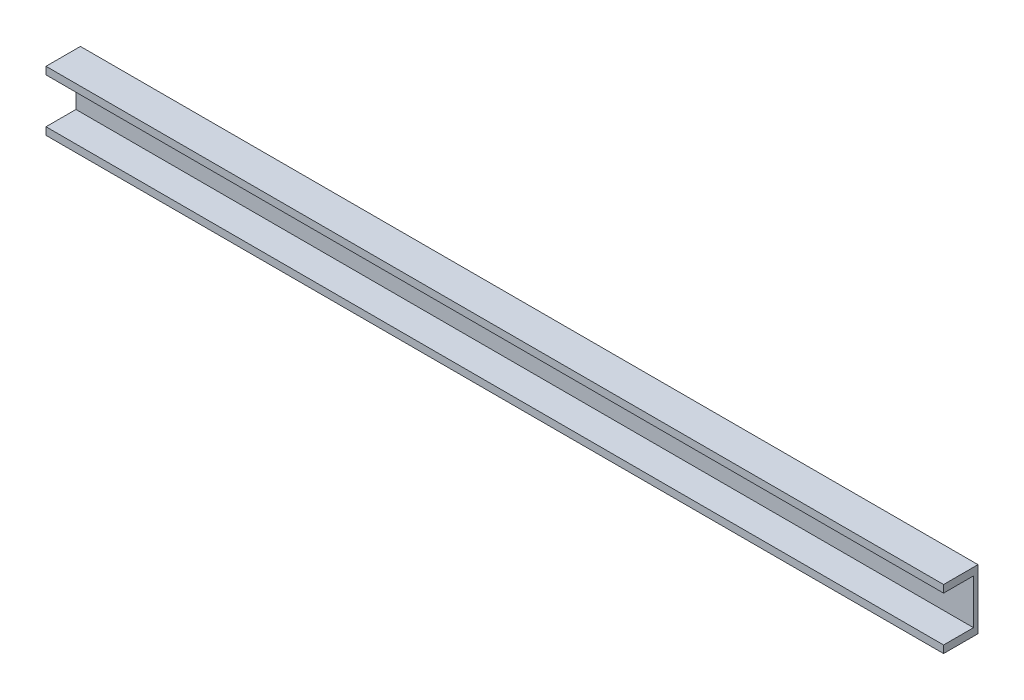
ISO-10303-21;
HEADER;
FILE_DESCRIPTION(('STEP AP214'),'2;1');
FILE_NAME('part.step','',(''),(''),'','','');
FILE_SCHEMA(('AUTOMOTIVE_DESIGN { 1 0 10303 214 1 1 1 1 }'));
ENDSEC;
DATA;
#1=APPLICATION_CONTEXT('core data for automotive mechanical design processes');
#2=APPLICATION_PROTOCOL_DEFINITION('international standard','automotive_design',2000,#1);
#3=PRODUCT_CONTEXT('',#1,'mechanical');
#4=PRODUCT('Part','Part','',(#3));
#5=PRODUCT_RELATED_PRODUCT_CATEGORY('part','',(#4));
#6=PRODUCT_DEFINITION_FORMATION('','',#4);
#7=PRODUCT_DEFINITION_CONTEXT('part definition',#1,'design');
#8=PRODUCT_DEFINITION('design','',#6,#7);
#9=PRODUCT_DEFINITION_SHAPE('','',#8);
#10=(LENGTH_UNIT() NAMED_UNIT(*) SI_UNIT(.MILLI.,.METRE.));
#11=(NAMED_UNIT(*) PLANE_ANGLE_UNIT() SI_UNIT($,.RADIAN.));
#12=(NAMED_UNIT(*) SI_UNIT($,.STERADIAN.) SOLID_ANGLE_UNIT());
#13=UNCERTAINTY_MEASURE_WITH_UNIT(LENGTH_MEASURE(1.E-05),#10,'distance_accuracy_value','');
#14=(GEOMETRIC_REPRESENTATION_CONTEXT(3) GLOBAL_UNCERTAINTY_ASSIGNED_CONTEXT((#13)) GLOBAL_UNIT_ASSIGNED_CONTEXT((#10,
#11,#12)) REPRESENTATION_CONTEXT('',''));
#15=CARTESIAN_POINT('',(0.,0.,0.));
#16=DIRECTION('',(0.,0.,1.));
#17=DIRECTION('',(1.,0.,0.));
#18=AXIS2_PLACEMENT_3D('',#15,#16,#17);
#19=CARTESIAN_POINT('',(0.,0.,3.));
#20=DIRECTION('',(0.,0.,1.));
#21=DIRECTION('',(1.,0.,0.));
#22=AXIS2_PLACEMENT_3D('',#19,#20,#21);
#23=PLANE('',#22);
#24=DIRECTION('',(0.,1.,0.));
#25=VECTOR('',#24,1.);
#26=CARTESIAN_POINT('',(-300.,0.,3.));
#27=LINE('',#26,#25);
#28=CARTESIAN_POINT('',(-300.,-15.,3.));
#29=VERTEX_POINT('',#28);
#30=CARTESIAN_POINT('',(-300.,15.,3.));
#31=VERTEX_POINT('',#30);
#32=EDGE_CURVE('E12',#29,#31,#27,.T.);
#33=ORIENTED_EDGE('',*,*,#32,.F.);
#34=DIRECTION('',(1.,0.,0.));
#35=VECTOR('',#34,1.);
#36=CARTESIAN_POINT('',(0.,-15.,3.));
#37=LINE('',#36,#35);
#38=CARTESIAN_POINT('',(300.,-15.,3.));
#39=VERTEX_POINT('',#38);
#40=EDGE_CURVE('E29',#29,#39,#37,.T.);
#41=ORIENTED_EDGE('',*,*,#40,.T.);
#42=DIRECTION('',(0.,1.,0.));
#43=VECTOR('',#42,1.);
#44=CARTESIAN_POINT('',(300.,0.,3.));
#45=LINE('',#44,#43);
#46=CARTESIAN_POINT('',(300.,15.,3.));
#47=VERTEX_POINT('',#46);
#48=EDGE_CURVE('E121',#39,#47,#45,.T.);
#49=ORIENTED_EDGE('',*,*,#48,.T.);
#50=DIRECTION('',(1.,0.,0.));
#51=VECTOR('',#50,1.);
#52=CARTESIAN_POINT('',(0.,15.,3.));
#53=LINE('',#52,#51);
#54=EDGE_CURVE('E123',#31,#47,#53,.T.);
#55=ORIENTED_EDGE('',*,*,#54,.F.);
#56=EDGE_LOOP('',(#33,#41,#49,#55));
#57=FACE_BOUND('',#56,.T.);
#58=ADVANCED_FACE('F20',(#57),#23,.T.);
#59=CARTESIAN_POINT('',(0.,-20.,3.));
#60=DIRECTION('',(0.,-1.,0.));
#61=DIRECTION('',(1.,0.,0.));
#62=AXIS2_PLACEMENT_3D('',#59,#60,#61);
#63=PLANE('',#62);
#64=DIRECTION('',(-1.,0.,0.));
#65=VECTOR('',#64,1.);
#66=CARTESIAN_POINT('',(0.,-20.,0.));
#67=LINE('',#66,#65);
#68=CARTESIAN_POINT('',(300.,-20.,0.));
#69=VERTEX_POINT('',#68);
#70=CARTESIAN_POINT('',(-300.,-20.,0.));
#71=VERTEX_POINT('',#70);
#72=EDGE_CURVE('E127',#69,#71,#67,.T.);
#73=ORIENTED_EDGE('',*,*,#72,.F.);
#74=DIRECTION('',(0.,0.,-1.));
#75=VECTOR('',#74,1.);
#76=CARTESIAN_POINT('',(300.,-20.,3.));
#77=LINE('',#76,#75);
#78=CARTESIAN_POINT('',(300.,-20.,23.));
#79=VERTEX_POINT('',#78);
#80=EDGE_CURVE('E132',#79,#69,#77,.T.);
#81=ORIENTED_EDGE('',*,*,#80,.F.);
#82=DIRECTION('',(-1.,0.,0.));
#83=VECTOR('',#82,1.);
#84=CARTESIAN_POINT('',(0.,-20.,23.));
#85=LINE('',#84,#83);
#86=CARTESIAN_POINT('',(-300.,-20.,23.));
#87=VERTEX_POINT('',#86);
#88=EDGE_CURVE('E149',#79,#87,#85,.T.);
#89=ORIENTED_EDGE('',*,*,#88,.T.);
#90=DIRECTION('',(0.,0.,-1.));
#91=VECTOR('',#90,1.);
#92=CARTESIAN_POINT('',(-300.,-20.,3.));
#93=LINE('',#92,#91);
#94=EDGE_CURVE('E145',#87,#71,#93,.T.);
#95=ORIENTED_EDGE('',*,*,#94,.T.);
#96=EDGE_LOOP('',(#73,#81,#89,#95));
#97=FACE_BOUND('',#96,.T.);
#98=ADVANCED_FACE('F189',(#97),#63,.T.);
#99=CARTESIAN_POINT('',(300.,0.,3.));
#100=DIRECTION('',(-1.,0.,0.));
#101=DIRECTION('',(0.,0.,1.));
#102=AXIS2_PLACEMENT_3D('',#99,#100,#101);
#103=PLANE('',#102);
#104=DIRECTION('',(0.,1.,0.));
#105=VECTOR('',#104,1.);
#106=CARTESIAN_POINT('',(300.,0.,0.));
#107=LINE('',#106,#105);
#108=CARTESIAN_POINT('',(300.,20.,0.));
#109=VERTEX_POINT('',#108);
#110=EDGE_CURVE('E140',#69,#109,#107,.T.);
#111=ORIENTED_EDGE('',*,*,#110,.T.);
#112=DIRECTION('',(0.,0.,-1.));
#113=VECTOR('',#112,1.);
#114=CARTESIAN_POINT('',(300.,20.,3.));
#115=LINE('',#114,#113);
#116=CARTESIAN_POINT('',(300.,20.,23.));
#117=VERTEX_POINT('',#116);
#118=EDGE_CURVE('E146',#117,#109,#115,.T.);
#119=ORIENTED_EDGE('',*,*,#118,.F.);
#120=DIRECTION('',(0.,1.,0.));
#121=VECTOR('',#120,1.);
#122=CARTESIAN_POINT('',(300.,0.,23.));
#123=LINE('',#122,#121);
#124=CARTESIAN_POINT('',(300.,15.,23.));
#125=VERTEX_POINT('',#124);
#126=EDGE_CURVE('E184',#125,#117,#123,.T.);
#127=ORIENTED_EDGE('',*,*,#126,.F.);
#128=DIRECTION('',(0.,0.,-1.));
#129=VECTOR('',#128,1.);
#130=CARTESIAN_POINT('',(300.,15.,23.));
#131=LINE('',#130,#129);
#132=EDGE_CURVE('E100',#125,#47,#131,.T.);
#133=ORIENTED_EDGE('',*,*,#132,.T.);
#134=ORIENTED_EDGE('',*,*,#48,.F.);
#135=DIRECTION('',(0.,0.,-1.));
#136=VECTOR('',#135,1.);
#137=CARTESIAN_POINT('',(300.,-15.,23.));
#138=LINE('',#137,#136);
#139=CARTESIAN_POINT('',(300.,-15.,23.));
#140=VERTEX_POINT('',#139);
#141=EDGE_CURVE('E174',#140,#39,#138,.T.);
#142=ORIENTED_EDGE('',*,*,#141,.F.);
#143=DIRECTION('',(0.,1.,0.));
#144=VECTOR('',#143,1.);
#145=CARTESIAN_POINT('',(300.,0.,23.));
#146=LINE('',#145,#144);
#147=EDGE_CURVE('E162',#79,#140,#146,.T.);
#148=ORIENTED_EDGE('',*,*,#147,.F.);
#149=ORIENTED_EDGE('',*,*,#80,.T.);
#150=EDGE_LOOP('',(#111,#119,#127,#133,#134,#142,#148,#149));
#151=FACE_BOUND('',#150,.T.);
#152=ADVANCED_FACE('F159',(#151),#103,.F.);
#153=CARTESIAN_POINT('',(0.,20.,3.));
#154=DIRECTION('',(0.,-1.,0.));
#155=DIRECTION('',(1.,0.,0.));
#156=AXIS2_PLACEMENT_3D('',#153,#154,#155);
#157=PLANE('',#156);
#158=DIRECTION('',(-1.,0.,0.));
#159=VECTOR('',#158,1.);
#160=CARTESIAN_POINT('',(0.,20.,0.));
#161=LINE('',#160,#159);
#162=CARTESIAN_POINT('',(-300.,20.,0.));
#163=VERTEX_POINT('',#162);
#164=EDGE_CURVE('E167',#109,#163,#161,.T.);
#165=ORIENTED_EDGE('',*,*,#164,.T.);
#166=DIRECTION('',(0.,0.,-1.));
#167=VECTOR('',#166,1.);
#168=CARTESIAN_POINT('',(-300.,20.,3.));
#169=LINE('',#168,#167);
#170=CARTESIAN_POINT('',(-300.,20.,23.));
#171=VERTEX_POINT('',#170);
#172=EDGE_CURVE('E171',#171,#163,#169,.T.);
#173=ORIENTED_EDGE('',*,*,#172,.F.);
#174=DIRECTION('',(-1.,0.,0.));
#175=VECTOR('',#174,1.);
#176=CARTESIAN_POINT('',(0.,20.,23.));
#177=LINE('',#176,#175);
#178=EDGE_CURVE('E108',#117,#171,#177,.T.);
#179=ORIENTED_EDGE('',*,*,#178,.F.);
#180=ORIENTED_EDGE('',*,*,#118,.T.);
#181=EDGE_LOOP('',(#165,#173,#179,#180));
#182=FACE_BOUND('',#181,.T.);
#183=ADVANCED_FACE('F187',(#182),#157,.F.);
#184=CARTESIAN_POINT('',(-300.,0.,3.));
#185=DIRECTION('',(-1.,0.,0.));
#186=DIRECTION('',(0.,0.,1.));
#187=AXIS2_PLACEMENT_3D('',#184,#185,#186);
#188=PLANE('',#187);
#189=DIRECTION('',(0.,1.,0.));
#190=VECTOR('',#189,1.);
#191=CARTESIAN_POINT('',(-300.,0.,0.));
#192=LINE('',#191,#190);
#193=EDGE_CURVE('E168',#71,#163,#192,.T.);
#194=ORIENTED_EDGE('',*,*,#193,.F.);
#195=ORIENTED_EDGE('',*,*,#94,.F.);
#196=DIRECTION('',(0.,1.,0.));
#197=VECTOR('',#196,1.);
#198=CARTESIAN_POINT('',(-300.,0.,23.));
#199=LINE('',#198,#197);
#200=CARTESIAN_POINT('',(-300.,-15.,23.));
#201=VERTEX_POINT('',#200);
#202=EDGE_CURVE('E218',#87,#201,#199,.T.);
#203=ORIENTED_EDGE('',*,*,#202,.T.);
#204=DIRECTION('',(0.,0.,-1.));
#205=VECTOR('',#204,1.);
#206=CARTESIAN_POINT('',(-300.,-15.,23.));
#207=LINE('',#206,#205);
#208=EDGE_CURVE('E93',#201,#29,#207,.T.);
#209=ORIENTED_EDGE('',*,*,#208,.T.);
#210=ORIENTED_EDGE('',*,*,#32,.T.);
#211=DIRECTION('',(0.,0.,-1.));
#212=VECTOR('',#211,1.);
#213=CARTESIAN_POINT('',(-300.,15.,23.));
#214=LINE('',#213,#212);
#215=CARTESIAN_POINT('',(-300.,15.,23.));
#216=VERTEX_POINT('',#215);
#217=EDGE_CURVE('E82',#216,#31,#214,.T.);
#218=ORIENTED_EDGE('',*,*,#217,.F.);
#219=DIRECTION('',(0.,1.,0.));
#220=VECTOR('',#219,1.);
#221=CARTESIAN_POINT('',(-300.,0.,23.));
#222=LINE('',#221,#220);
#223=EDGE_CURVE('E88',#216,#171,#222,.T.);
#224=ORIENTED_EDGE('',*,*,#223,.T.);
#225=ORIENTED_EDGE('',*,*,#172,.T.);
#226=EDGE_LOOP('',(#194,#195,#203,#209,#210,#218,#224,#225));
#227=FACE_BOUND('',#226,.T.);
#228=ADVANCED_FACE('F85',(#227),#188,.T.);
#229=CARTESIAN_POINT('',(0.,0.,0.));
#230=DIRECTION('',(0.,0.,1.));
#231=DIRECTION('',(1.,0.,0.));
#232=AXIS2_PLACEMENT_3D('',#229,#230,#231);
#233=PLANE('',#232);
#234=ORIENTED_EDGE('',*,*,#72,.T.);
#235=ORIENTED_EDGE('',*,*,#193,.T.);
#236=ORIENTED_EDGE('',*,*,#164,.F.);
#237=ORIENTED_EDGE('',*,*,#110,.F.);
#238=EDGE_LOOP('',(#234,#235,#236,#237));
#239=FACE_BOUND('',#238,.T.);
#240=ADVANCED_FACE('F165',(#239),#233,.F.);
#241=CARTESIAN_POINT('',(0.,15.,23.));
#242=DIRECTION('',(0.,1.,0.));
#243=DIRECTION('',(0.,0.,1.));
#244=AXIS2_PLACEMENT_3D('',#241,#242,#243);
#245=PLANE('',#244);
#246=ORIENTED_EDGE('',*,*,#54,.T.);
#247=ORIENTED_EDGE('',*,*,#132,.F.);
#248=DIRECTION('',(1.,0.,0.));
#249=VECTOR('',#248,1.);
#250=CARTESIAN_POINT('',(0.,15.,23.));
#251=LINE('',#250,#249);
#252=EDGE_CURVE('E97',#216,#125,#251,.T.);
#253=ORIENTED_EDGE('',*,*,#252,.F.);
#254=ORIENTED_EDGE('',*,*,#217,.T.);
#255=EDGE_LOOP('',(#246,#247,#253,#254));
#256=FACE_BOUND('',#255,.T.);
#257=ADVANCED_FACE('F98',(#256),#245,.F.);
#258=CARTESIAN_POINT('',(0.,0.,23.));
#259=DIRECTION('',(0.,0.,1.));
#260=DIRECTION('',(1.,0.,0.));
#261=AXIS2_PLACEMENT_3D('',#258,#259,#260);
#262=PLANE('',#261);
#263=ORIENTED_EDGE('',*,*,#223,.F.);
#264=ORIENTED_EDGE('',*,*,#252,.T.);
#265=ORIENTED_EDGE('',*,*,#126,.T.);
#266=ORIENTED_EDGE('',*,*,#178,.T.);
#267=EDGE_LOOP('',(#263,#264,#265,#266));
#268=FACE_BOUND('',#267,.T.);
#269=ADVANCED_FACE('F106',(#268),#262,.T.);
#270=CARTESIAN_POINT('',(0.,-15.,23.));
#271=DIRECTION('',(0.,1.,0.));
#272=DIRECTION('',(0.,0.,1.));
#273=AXIS2_PLACEMENT_3D('',#270,#271,#272);
#274=PLANE('',#273);
#275=ORIENTED_EDGE('',*,*,#40,.F.);
#276=ORIENTED_EDGE('',*,*,#208,.F.);
#277=DIRECTION('',(1.,0.,0.));
#278=VECTOR('',#277,1.);
#279=CARTESIAN_POINT('',(0.,-15.,23.));
#280=LINE('',#279,#278);
#281=EDGE_CURVE('E104',#201,#140,#280,.T.);
#282=ORIENTED_EDGE('',*,*,#281,.T.);
#283=ORIENTED_EDGE('',*,*,#141,.T.);
#284=EDGE_LOOP('',(#275,#276,#282,#283));
#285=FACE_BOUND('',#284,.T.);
#286=ADVANCED_FACE('F207',(#285),#274,.T.);
#287=CARTESIAN_POINT('',(0.,0.,23.));
#288=DIRECTION('',(0.,0.,1.));
#289=DIRECTION('',(1.,0.,0.));
#290=AXIS2_PLACEMENT_3D('',#287,#288,#289);
#291=PLANE('',#290);
#292=ORIENTED_EDGE('',*,*,#281,.F.);
#293=ORIENTED_EDGE('',*,*,#202,.F.);
#294=ORIENTED_EDGE('',*,*,#88,.F.);
#295=ORIENTED_EDGE('',*,*,#147,.T.);
#296=EDGE_LOOP('',(#292,#293,#294,#295));
#297=FACE_BOUND('',#296,.T.);
#298=ADVANCED_FACE('F210',(#297),#291,.T.);
#299=CLOSED_SHELL('',(#58,#98,#152,#183,#228,#240,#257,#269,#286,#298));
#300=MANIFOLD_SOLID_BREP('B1',#299);
#301=ADVANCED_BREP_SHAPE_REPRESENTATION('',(#18,#300),#14);
#302=SHAPE_DEFINITION_REPRESENTATION(#9,#301);
ENDSEC;
END-ISO-10303-21;
